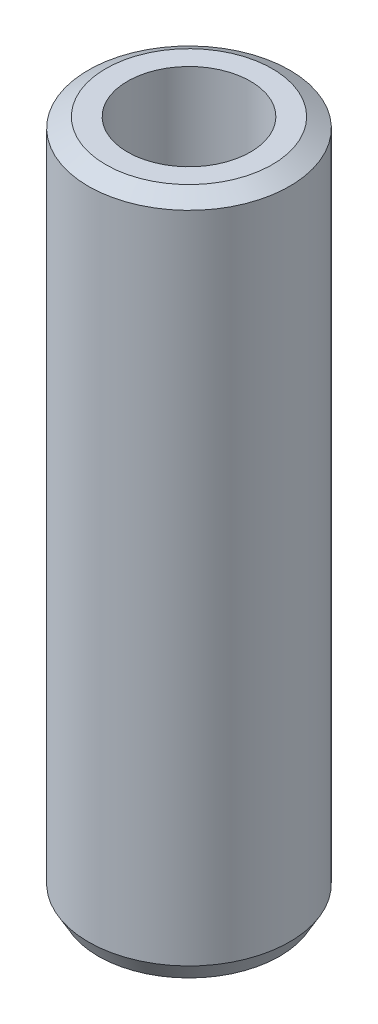
ISO-10303-21;
HEADER;
FILE_DESCRIPTION(('STEP AP214'),'2;1');
FILE_NAME('part.step','',(''),(''),'','','');
FILE_SCHEMA(('AUTOMOTIVE_DESIGN { 1 0 10303 214 1 1 1 1 }'));
ENDSEC;
DATA;
#1=APPLICATION_CONTEXT('core data for automotive mechanical design processes');
#2=APPLICATION_PROTOCOL_DEFINITION('international standard','automotive_design',2000,#1);
#3=PRODUCT_CONTEXT('',#1,'mechanical');
#4=PRODUCT('Part','Part','',(#3));
#5=PRODUCT_RELATED_PRODUCT_CATEGORY('part','',(#4));
#6=PRODUCT_DEFINITION_FORMATION('','',#4);
#7=PRODUCT_DEFINITION_CONTEXT('part definition',#1,'design');
#8=PRODUCT_DEFINITION('design','',#6,#7);
#9=PRODUCT_DEFINITION_SHAPE('','',#8);
#10=(LENGTH_UNIT() NAMED_UNIT(*) SI_UNIT(.MILLI.,.METRE.));
#11=(NAMED_UNIT(*) PLANE_ANGLE_UNIT() SI_UNIT($,.RADIAN.));
#12=(NAMED_UNIT(*) SI_UNIT($,.STERADIAN.) SOLID_ANGLE_UNIT());
#13=UNCERTAINTY_MEASURE_WITH_UNIT(LENGTH_MEASURE(1.E-05),#10,'distance_accuracy_value','');
#14=(GEOMETRIC_REPRESENTATION_CONTEXT(3) GLOBAL_UNCERTAINTY_ASSIGNED_CONTEXT((#13)) GLOBAL_UNIT_ASSIGNED_CONTEXT((#10,
#11,#12)) REPRESENTATION_CONTEXT('',''));
#15=CARTESIAN_POINT('',(0.,0.,0.));
#16=DIRECTION('',(0.,0.,1.));
#17=DIRECTION('',(1.,0.,0.));
#18=AXIS2_PLACEMENT_3D('',#15,#16,#17);
#19=CARTESIAN_POINT('',(0.,186.252866447861,0.));
#20=DIRECTION('',(0.,-1.,0.));
#21=DIRECTION('',(0.,0.,-1.));
#22=AXIS2_PLACEMENT_3D('',#19,#20,#21);
#23=CYLINDRICAL_SURFACE('',#22,27.5);
#24=CARTESIAN_POINT('',(0.,183.525132077795,0.));
#25=DIRECTION('',(0.,1.,0.));
#26=DIRECTION('',(0.,0.,1.));
#27=AXIS2_PLACEMENT_3D('',#24,#25,#26);
#28=CIRCLE('',#27,27.5);
#29=CARTESIAN_POINT('',(0.,183.525132077795,27.5));
#30=VERTEX_POINT('',#29);
#31=EDGE_CURVE('E50',#30,#30,#28,.F.);
#32=ORIENTED_EDGE('',*,*,#31,.T.);
#33=EDGE_LOOP('',(#32));
#34=FACE_BOUND('',#33,.T.);
#35=CARTESIAN_POINT('',(0.,4.76655963497424,0.));
#36=DIRECTION('',(0.,1.,0.));
#37=DIRECTION('',(0.,0.,1.));
#38=AXIS2_PLACEMENT_3D('',#35,#36,#37);
#39=CIRCLE('',#38,27.5);
#40=CARTESIAN_POINT('',(0.,4.76655963497424,27.5));
#41=VERTEX_POINT('',#40);
#42=EDGE_CURVE('E51',#41,#41,#39,.T.);
#43=ORIENTED_EDGE('',*,*,#42,.T.);
#44=EDGE_LOOP('',(#43));
#45=FACE_BOUND('',#44,.T.);
#46=ADVANCED_FACE('F39',(#34,#45),#23,.T.);
#47=CARTESIAN_POINT('',(0.,186.252866447861,0.));
#48=DIRECTION('',(0.,1.,0.));
#49=DIRECTION('',(0.,0.,1.));
#50=AXIS2_PLACEMENT_3D('',#47,#48,#49);
#51=PLANE('',#50);
#52=CARTESIAN_POINT('',(0.,186.252866447861,0.));
#53=DIRECTION('',(0.,1.,0.));
#54=DIRECTION('',(0.,0.,1.));
#55=AXIS2_PLACEMENT_3D('',#52,#53,#54);
#56=CIRCLE('',#55,22.7334403650258);
#57=CARTESIAN_POINT('',(0.,186.252866447861,22.7334403650258));
#58=VERTEX_POINT('',#57);
#59=EDGE_CURVE('E54',#58,#58,#56,.T.);
#60=ORIENTED_EDGE('',*,*,#59,.T.);
#61=EDGE_LOOP('',(#60));
#62=FACE_BOUND('',#61,.T.);
#63=CARTESIAN_POINT('',(0.,186.252866447861,0.));
#64=DIRECTION('',(0.,1.,0.));
#65=DIRECTION('',(0.,0.,1.));
#66=AXIS2_PLACEMENT_3D('',#63,#64,#65);
#67=CIRCLE('',#66,16.7846935313512);
#68=CARTESIAN_POINT('',(0.,186.252866447861,16.7846935313512));
#69=VERTEX_POINT('',#68);
#70=EDGE_CURVE('E58',#69,#69,#67,.T.);
#71=ORIENTED_EDGE('',*,*,#70,.F.);
#72=EDGE_LOOP('',(#71));
#73=FACE_BOUND('',#72,.T.);
#74=ADVANCED_FACE('F69',(#62,#73),#51,.T.);
#75=CARTESIAN_POINT('',(0.,0.,0.));
#76=DIRECTION('',(0.,1.,0.));
#77=DIRECTION('',(0.,0.,1.));
#78=AXIS2_PLACEMENT_3D('',#75,#76,#77);
#79=PLANE('',#78);
#80=CARTESIAN_POINT('',(0.,0.,0.));
#81=DIRECTION('',(0.,1.,0.));
#82=DIRECTION('',(0.,0.,1.));
#83=AXIS2_PLACEMENT_3D('',#80,#81,#82);
#84=CIRCLE('',#83,24.7722656299341);
#85=CARTESIAN_POINT('',(0.,0.,24.7722656299341));
#86=VERTEX_POINT('',#85);
#87=EDGE_CURVE('E10',#86,#86,#84,.F.);
#88=ORIENTED_EDGE('',*,*,#87,.T.);
#89=EDGE_LOOP('',(#88));
#90=FACE_BOUND('',#89,.T.);
#91=CARTESIAN_POINT('',(0.,0.,0.));
#92=DIRECTION('',(0.,1.,0.));
#93=DIRECTION('',(0.,0.,1.));
#94=AXIS2_PLACEMENT_3D('',#91,#92,#93);
#95=CIRCLE('',#94,16.7846935313512);
#96=CARTESIAN_POINT('',(0.,0.,16.7846935313512));
#97=VERTEX_POINT('',#96);
#98=EDGE_CURVE('E63',#97,#97,#95,.T.);
#99=ORIENTED_EDGE('',*,*,#98,.T.);
#100=EDGE_LOOP('',(#99));
#101=FACE_BOUND('',#100,.T.);
#102=ADVANCED_FACE('F75',(#90,#101),#79,.F.);
#103=CARTESIAN_POINT('',(0.,186.252866447861,0.));
#104=DIRECTION('',(0.,-1.,0.));
#105=DIRECTION('',(0.,0.,-1.));
#106=AXIS2_PLACEMENT_3D('',#103,#104,#105);
#107=CYLINDRICAL_SURFACE('',#106,16.7846935313512);
#108=ORIENTED_EDGE('',*,*,#70,.T.);
#109=EDGE_LOOP('',(#108));
#110=FACE_BOUND('',#109,.T.);
#111=ORIENTED_EDGE('',*,*,#98,.F.);
#112=EDGE_LOOP('',(#111));
#113=FACE_BOUND('',#112,.T.);
#114=ADVANCED_FACE('F70',(#110,#113),#107,.F.);
#115=CARTESIAN_POINT('',(0.,186.252866447861,0.));
#116=DIRECTION('',(0.,-1.,0.));
#117=DIRECTION('',(0.,0.,-1.));
#118=AXIS2_PLACEMENT_3D('',#115,#116,#117);
#119=CONICAL_SURFACE('',#118,22.7334403650258,1.0510200402627);
#120=ORIENTED_EDGE('',*,*,#31,.F.);
#121=EDGE_LOOP('',(#120));
#122=FACE_BOUND('',#121,.T.);
#123=ORIENTED_EDGE('',*,*,#59,.F.);
#124=EDGE_LOOP('',(#123));
#125=FACE_BOUND('',#124,.T.);
#126=ADVANCED_FACE('F81',(#122,#125),#119,.T.);
#127=CARTESIAN_POINT('',(0.,4.76655963497424,0.));
#128=DIRECTION('',(0.,1.,0.));
#129=DIRECTION('',(0.,0.,1.));
#130=AXIS2_PLACEMENT_3D('',#127,#128,#129);
#131=CONICAL_SURFACE('',#130,27.5,0.519776286532205);
#132=ORIENTED_EDGE('',*,*,#87,.F.);
#133=EDGE_LOOP('',(#132));
#134=FACE_BOUND('',#133,.T.);
#135=ORIENTED_EDGE('',*,*,#42,.F.);
#136=EDGE_LOOP('',(#135));
#137=FACE_BOUND('',#136,.T.);
#138=ADVANCED_FACE('F45',(#134,#137),#131,.T.);
#139=CLOSED_SHELL('',(#46,#74,#102,#114,#126,#138));
#140=MANIFOLD_SOLID_BREP('B2',#139);
#141=ADVANCED_BREP_SHAPE_REPRESENTATION('',(#18,#140),#14);
#142=SHAPE_DEFINITION_REPRESENTATION(#9,#141);
ENDSEC;
END-ISO-10303-21;
